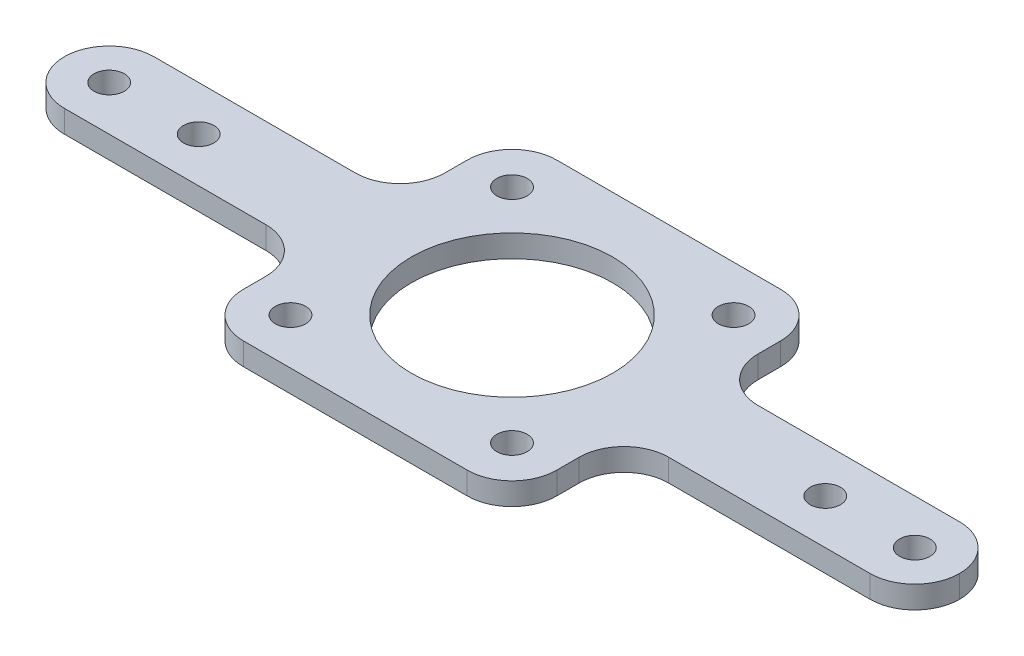
ISO-10303-21;
HEADER;
FILE_DESCRIPTION(('STEP AP214'),'2;1');
FILE_NAME('part.step','',(''),(''),'','','');
FILE_SCHEMA(('AUTOMOTIVE_DESIGN { 1 0 10303 214 1 1 1 1 }'));
ENDSEC;
DATA;
#1=APPLICATION_CONTEXT('core data for automotive mechanical design processes');
#2=APPLICATION_PROTOCOL_DEFINITION('international standard','automotive_design',2000,#1);
#3=PRODUCT_CONTEXT('',#1,'mechanical');
#4=PRODUCT('Part','Part','',(#3));
#5=PRODUCT_RELATED_PRODUCT_CATEGORY('part','',(#4));
#6=PRODUCT_DEFINITION_FORMATION('','',#4);
#7=PRODUCT_DEFINITION_CONTEXT('part definition',#1,'design');
#8=PRODUCT_DEFINITION('design','',#6,#7);
#9=PRODUCT_DEFINITION_SHAPE('','',#8);
#10=(LENGTH_UNIT() NAMED_UNIT(*) SI_UNIT(.MILLI.,.METRE.));
#11=(NAMED_UNIT(*) PLANE_ANGLE_UNIT() SI_UNIT($,.RADIAN.));
#12=(NAMED_UNIT(*) SI_UNIT($,.STERADIAN.) SOLID_ANGLE_UNIT());
#13=UNCERTAINTY_MEASURE_WITH_UNIT(LENGTH_MEASURE(1.E-05),#10,'distance_accuracy_value','');
#14=(GEOMETRIC_REPRESENTATION_CONTEXT(3) GLOBAL_UNCERTAINTY_ASSIGNED_CONTEXT((#13)) GLOBAL_UNIT_ASSIGNED_CONTEXT((#10,
#11,#12)) REPRESENTATION_CONTEXT('',''));
#15=CARTESIAN_POINT('',(0.,0.,0.));
#16=DIRECTION('',(0.,0.,1.));
#17=DIRECTION('',(1.,0.,0.));
#18=AXIS2_PLACEMENT_3D('',#15,#16,#17);
#19=CARTESIAN_POINT('',(22.225,3.175,0.));
#20=DIRECTION('',(-1.,0.,0.));
#21=DIRECTION('',(0.,0.,1.));
#22=AXIS2_PLACEMENT_3D('',#19,#20,#21);
#23=PLANE('',#22);
#24=DIRECTION('',(0.,0.,-1.));
#25=VECTOR('',#24,1.);
#26=CARTESIAN_POINT('',(22.225,3.175,0.));
#27=LINE('',#26,#25);
#28=CARTESIAN_POINT('',(22.225,3.175,15.875));
#29=VERTEX_POINT('',#28);
#30=CARTESIAN_POINT('',(22.225,3.175,12.7));
#31=VERTEX_POINT('',#30);
#32=EDGE_CURVE('E236',#29,#31,#27,.T.);
#33=ORIENTED_EDGE('',*,*,#32,.F.);
#34=DIRECTION('',(0.,-1.,0.));
#35=VECTOR('',#34,1.);
#36=CARTESIAN_POINT('',(22.225,3.175,15.875));
#37=LINE('',#36,#35);
#38=CARTESIAN_POINT('',(22.225,0.,15.875));
#39=VERTEX_POINT('',#38);
#40=EDGE_CURVE('E320',#29,#39,#37,.T.);
#41=ORIENTED_EDGE('',*,*,#40,.T.);
#42=DIRECTION('',(0.,0.,-1.));
#43=VECTOR('',#42,1.);
#44=CARTESIAN_POINT('',(22.225,0.,0.));
#45=LINE('',#44,#43);
#46=CARTESIAN_POINT('',(22.225,0.,12.7));
#47=VERTEX_POINT('',#46);
#48=EDGE_CURVE('E374',#39,#47,#45,.T.);
#49=ORIENTED_EDGE('',*,*,#48,.T.);
#50=DIRECTION('',(0.,-1.,0.));
#51=VECTOR('',#50,1.);
#52=CARTESIAN_POINT('',(22.225,3.175,12.7));
#53=LINE('',#52,#51);
#54=EDGE_CURVE('E242',#47,#31,#53,.F.);
#55=ORIENTED_EDGE('',*,*,#54,.T.);
#56=EDGE_LOOP('',(#33,#41,#49,#55));
#57=FACE_BOUND('',#56,.T.);
#58=ADVANCED_FACE('F38',(#57),#23,.F.);
#59=CARTESIAN_POINT('',(0.,3.175,6.35));
#60=DIRECTION('',(0.,0.,1.));
#61=DIRECTION('',(1.,0.,0.));
#62=AXIS2_PLACEMENT_3D('',#59,#60,#61);
#63=PLANE('',#62);
#64=DIRECTION('',(-1.,0.,0.));
#65=VECTOR('',#64,1.);
#66=CARTESIAN_POINT('',(0.,0.,6.35));
#67=LINE('',#66,#65);
#68=CARTESIAN_POINT('',(57.15,0.,6.34999999999999));
#69=VERTEX_POINT('',#68);
#70=CARTESIAN_POINT('',(28.575,0.,6.34999999999999));
#71=VERTEX_POINT('',#70);
#72=EDGE_CURVE('E222',#69,#71,#67,.T.);
#73=ORIENTED_EDGE('',*,*,#72,.F.);
#74=DIRECTION('',(0.,-1.,0.));
#75=VECTOR('',#74,1.);
#76=CARTESIAN_POINT('',(57.15,3.175,6.34999999999999));
#77=LINE('',#76,#75);
#78=CARTESIAN_POINT('',(57.15,3.175,6.34999999999999));
#79=VERTEX_POINT('',#78);
#80=EDGE_CURVE('E318',#69,#79,#77,.F.);
#81=ORIENTED_EDGE('',*,*,#80,.T.);
#82=DIRECTION('',(-1.,0.,0.));
#83=VECTOR('',#82,1.);
#84=CARTESIAN_POINT('',(0.,3.175,6.35));
#85=LINE('',#84,#83);
#86=CARTESIAN_POINT('',(28.575,3.175,6.34999999999999));
#87=VERTEX_POINT('',#86);
#88=EDGE_CURVE('E378',#79,#87,#85,.T.);
#89=ORIENTED_EDGE('',*,*,#88,.T.);
#90=DIRECTION('',(0.,-1.,0.));
#91=VECTOR('',#90,1.);
#92=CARTESIAN_POINT('',(28.575,3.175,6.34999999999999));
#93=LINE('',#92,#91);
#94=EDGE_CURVE('E239',#87,#71,#93,.T.);
#95=ORIENTED_EDGE('',*,*,#94,.T.);
#96=EDGE_LOOP('',(#73,#81,#89,#95));
#97=FACE_BOUND('',#96,.T.);
#98=ADVANCED_FACE('F409',(#97),#63,.T.);
#99=CARTESIAN_POINT('',(0.,3.175,-6.35));
#100=DIRECTION('',(0.,0.,1.));
#101=DIRECTION('',(1.,0.,0.));
#102=AXIS2_PLACEMENT_3D('',#99,#100,#101);
#103=PLANE('',#102);
#104=DIRECTION('',(-1.,0.,0.));
#105=VECTOR('',#104,1.);
#106=CARTESIAN_POINT('',(0.,3.175,-6.35));
#107=LINE('',#106,#105);
#108=CARTESIAN_POINT('',(57.15,3.175,-6.35000000000001));
#109=VERTEX_POINT('',#108);
#110=CARTESIAN_POINT('',(28.575,3.175,-6.35));
#111=VERTEX_POINT('',#110);
#112=EDGE_CURVE('E380',#109,#111,#107,.T.);
#113=ORIENTED_EDGE('',*,*,#112,.F.);
#114=DIRECTION('',(0.,-1.,0.));
#115=VECTOR('',#114,1.);
#116=CARTESIAN_POINT('',(57.15,3.175,-6.35000000000001));
#117=LINE('',#116,#115);
#118=CARTESIAN_POINT('',(57.15,0.,-6.35000000000001));
#119=VERTEX_POINT('',#118);
#120=EDGE_CURVE('E315',#109,#119,#117,.T.);
#121=ORIENTED_EDGE('',*,*,#120,.T.);
#122=DIRECTION('',(-1.,0.,0.));
#123=VECTOR('',#122,1.);
#124=CARTESIAN_POINT('',(0.,0.,-6.35));
#125=LINE('',#124,#123);
#126=CARTESIAN_POINT('',(28.575,0.,-6.35));
#127=VERTEX_POINT('',#126);
#128=EDGE_CURVE('E218',#119,#127,#125,.T.);
#129=ORIENTED_EDGE('',*,*,#128,.T.);
#130=DIRECTION('',(0.,-1.,0.));
#131=VECTOR('',#130,1.);
#132=CARTESIAN_POINT('',(28.575,3.175,-6.35));
#133=LINE('',#132,#131);
#134=EDGE_CURVE('E196',#127,#111,#133,.F.);
#135=ORIENTED_EDGE('',*,*,#134,.T.);
#136=EDGE_LOOP('',(#113,#121,#129,#135));
#137=FACE_BOUND('',#136,.T.);
#138=ADVANCED_FACE('F438',(#137),#103,.F.);
#139=CARTESIAN_POINT('',(22.225,3.175,0.));
#140=DIRECTION('',(-1.,0.,0.));
#141=DIRECTION('',(0.,0.,1.));
#142=AXIS2_PLACEMENT_3D('',#139,#140,#141);
#143=PLANE('',#142);
#144=DIRECTION('',(0.,0.,-1.));
#145=VECTOR('',#144,1.);
#146=CARTESIAN_POINT('',(22.225,0.,0.));
#147=LINE('',#146,#145);
#148=CARTESIAN_POINT('',(22.225,0.,-12.7));
#149=VERTEX_POINT('',#148);
#150=CARTESIAN_POINT('',(22.225,0.,-15.875));
#151=VERTEX_POINT('',#150);
#152=EDGE_CURVE('E207',#149,#151,#147,.T.);
#153=ORIENTED_EDGE('',*,*,#152,.T.);
#154=DIRECTION('',(0.,-1.,0.));
#155=VECTOR('',#154,1.);
#156=CARTESIAN_POINT('',(22.225,3.175,-15.875));
#157=LINE('',#156,#155);
#158=CARTESIAN_POINT('',(22.225,3.175,-15.875));
#159=VERTEX_POINT('',#158);
#160=EDGE_CURVE('E313',#151,#159,#157,.F.);
#161=ORIENTED_EDGE('',*,*,#160,.T.);
#162=DIRECTION('',(0.,0.,-1.));
#163=VECTOR('',#162,1.);
#164=CARTESIAN_POINT('',(22.225,3.175,0.));
#165=LINE('',#164,#163);
#166=CARTESIAN_POINT('',(22.225,3.175,-12.7));
#167=VERTEX_POINT('',#166);
#168=EDGE_CURVE('E210',#167,#159,#165,.T.);
#169=ORIENTED_EDGE('',*,*,#168,.F.);
#170=DIRECTION('',(0.,-1.,0.));
#171=VECTOR('',#170,1.);
#172=CARTESIAN_POINT('',(22.225,0.,-12.7));
#173=LINE('',#172,#171);
#174=EDGE_CURVE('E194',#167,#149,#173,.T.);
#175=ORIENTED_EDGE('',*,*,#174,.T.);
#176=EDGE_LOOP('',(#153,#161,#169,#175));
#177=FACE_BOUND('',#176,.T.);
#178=ADVANCED_FACE('F206',(#177),#143,.F.);
#179=CARTESIAN_POINT('',(0.,3.175,-22.225));
#180=DIRECTION('',(0.,0.,-1.));
#181=DIRECTION('',(-1.,0.,0.));
#182=AXIS2_PLACEMENT_3D('',#179,#180,#181);
#183=PLANE('',#182);
#184=DIRECTION('',(1.,0.,0.));
#185=VECTOR('',#184,1.);
#186=CARTESIAN_POINT('',(0.,0.,-22.225));
#187=LINE('',#186,#185);
#188=CARTESIAN_POINT('',(-15.875,0.,-22.225));
#189=VERTEX_POINT('',#188);
#190=CARTESIAN_POINT('',(15.875,0.,-22.225));
#191=VERTEX_POINT('',#190);
#192=EDGE_CURVE('E217',#189,#191,#187,.T.);
#193=ORIENTED_EDGE('',*,*,#192,.F.);
#194=DIRECTION('',(0.,-1.,0.));
#195=VECTOR('',#194,1.);
#196=CARTESIAN_POINT('',(-15.875,3.175,-22.225));
#197=LINE('',#196,#195);
#198=CARTESIAN_POINT('',(-15.875,3.175,-22.225));
#199=VERTEX_POINT('',#198);
#200=EDGE_CURVE('E311',#189,#199,#197,.F.);
#201=ORIENTED_EDGE('',*,*,#200,.T.);
#202=DIRECTION('',(1.,0.,0.));
#203=VECTOR('',#202,1.);
#204=CARTESIAN_POINT('',(0.,3.175,-22.225));
#205=LINE('',#204,#203);
#206=CARTESIAN_POINT('',(15.875,3.175,-22.225));
#207=VERTEX_POINT('',#206);
#208=EDGE_CURVE('E383',#199,#207,#205,.T.);
#209=ORIENTED_EDGE('',*,*,#208,.T.);
#210=DIRECTION('',(0.,-1.,0.));
#211=VECTOR('',#210,1.);
#212=CARTESIAN_POINT('',(15.875,0.,-22.225));
#213=LINE('',#212,#211);
#214=EDGE_CURVE('E308',#207,#191,#213,.T.);
#215=ORIENTED_EDGE('',*,*,#214,.T.);
#216=EDGE_LOOP('',(#193,#201,#209,#215));
#217=FACE_BOUND('',#216,.T.);
#218=ADVANCED_FACE('F481',(#217),#183,.T.);
#219=CARTESIAN_POINT('',(-22.225,3.175,0.));
#220=DIRECTION('',(-1.,0.,0.));
#221=DIRECTION('',(0.,0.,1.));
#222=AXIS2_PLACEMENT_3D('',#219,#220,#221);
#223=PLANE('',#222);
#224=DIRECTION('',(0.,0.,-1.));
#225=VECTOR('',#224,1.);
#226=CARTESIAN_POINT('',(-22.225,3.175,0.));
#227=LINE('',#226,#225);
#228=CARTESIAN_POINT('',(-22.225,3.175,-12.7));
#229=VERTEX_POINT('',#228);
#230=CARTESIAN_POINT('',(-22.225,3.175,-15.875));
#231=VERTEX_POINT('',#230);
#232=EDGE_CURVE('E386',#229,#231,#227,.T.);
#233=ORIENTED_EDGE('',*,*,#232,.T.);
#234=DIRECTION('',(0.,-1.,0.));
#235=VECTOR('',#234,1.);
#236=CARTESIAN_POINT('',(-22.225,3.175,-15.875));
#237=LINE('',#236,#235);
#238=CARTESIAN_POINT('',(-22.225,0.,-15.875));
#239=VERTEX_POINT('',#238);
#240=EDGE_CURVE('E305',#231,#239,#237,.T.);
#241=ORIENTED_EDGE('',*,*,#240,.T.);
#242=DIRECTION('',(0.,0.,-1.));
#243=VECTOR('',#242,1.);
#244=CARTESIAN_POINT('',(-22.225,0.,0.));
#245=LINE('',#244,#243);
#246=CARTESIAN_POINT('',(-22.225,0.,-12.7));
#247=VERTEX_POINT('',#246);
#248=EDGE_CURVE('E220',#247,#239,#245,.T.);
#249=ORIENTED_EDGE('',*,*,#248,.F.);
#250=DIRECTION('',(0.,-1.,0.));
#251=VECTOR('',#250,1.);
#252=CARTESIAN_POINT('',(-22.225,3.175,-12.7));
#253=LINE('',#252,#251);
#254=EDGE_CURVE('E201',#247,#229,#253,.F.);
#255=ORIENTED_EDGE('',*,*,#254,.T.);
#256=EDGE_LOOP('',(#233,#241,#249,#255));
#257=FACE_BOUND('',#256,.T.);
#258=ADVANCED_FACE('F487',(#257),#223,.T.);
#259=CARTESIAN_POINT('',(0.,3.175,-6.35));
#260=DIRECTION('',(0.,0.,1.));
#261=DIRECTION('',(1.,0.,0.));
#262=AXIS2_PLACEMENT_3D('',#259,#260,#261);
#263=PLANE('',#262);
#264=DIRECTION('',(-1.,0.,0.));
#265=VECTOR('',#264,1.);
#266=CARTESIAN_POINT('',(0.,0.,-6.35));
#267=LINE('',#266,#265);
#268=CARTESIAN_POINT('',(-28.575,0.,-6.35));
#269=VERTEX_POINT('',#268);
#270=CARTESIAN_POINT('',(-57.15,0.,-6.34999999999999));
#271=VERTEX_POINT('',#270);
#272=EDGE_CURVE('E228',#269,#271,#267,.T.);
#273=ORIENTED_EDGE('',*,*,#272,.T.);
#274=DIRECTION('',(0.,-1.,0.));
#275=VECTOR('',#274,1.);
#276=CARTESIAN_POINT('',(-57.15,3.175,-6.34999999999999));
#277=LINE('',#276,#275);
#278=CARTESIAN_POINT('',(-57.15,3.175,-6.34999999999999));
#279=VERTEX_POINT('',#278);
#280=EDGE_CURVE('E303',#271,#279,#277,.F.);
#281=ORIENTED_EDGE('',*,*,#280,.T.);
#282=DIRECTION('',(-1.,0.,0.));
#283=VECTOR('',#282,1.);
#284=CARTESIAN_POINT('',(0.,3.175,-6.35));
#285=LINE('',#284,#283);
#286=CARTESIAN_POINT('',(-28.575,3.175,-6.35));
#287=VERTEX_POINT('',#286);
#288=EDGE_CURVE('E389',#287,#279,#285,.T.);
#289=ORIENTED_EDGE('',*,*,#288,.F.);
#290=DIRECTION('',(0.,-1.,0.));
#291=VECTOR('',#290,1.);
#292=CARTESIAN_POINT('',(-28.575,3.175,-6.35));
#293=LINE('',#292,#291);
#294=EDGE_CURVE('E250',#287,#269,#293,.T.);
#295=ORIENTED_EDGE('',*,*,#294,.T.);
#296=EDGE_LOOP('',(#273,#281,#289,#295));
#297=FACE_BOUND('',#296,.T.);
#298=ADVANCED_FACE('F495',(#297),#263,.F.);
#299=CARTESIAN_POINT('',(0.,3.175,6.35));
#300=DIRECTION('',(0.,0.,1.));
#301=DIRECTION('',(1.,0.,0.));
#302=AXIS2_PLACEMENT_3D('',#299,#300,#301);
#303=PLANE('',#302);
#304=DIRECTION('',(-1.,0.,0.));
#305=VECTOR('',#304,1.);
#306=CARTESIAN_POINT('',(0.,3.175,6.35));
#307=LINE('',#306,#305);
#308=CARTESIAN_POINT('',(-28.575,3.175,6.35));
#309=VERTEX_POINT('',#308);
#310=CARTESIAN_POINT('',(-57.15,3.175,6.35));
#311=VERTEX_POINT('',#310);
#312=EDGE_CURVE('E392',#309,#311,#307,.T.);
#313=ORIENTED_EDGE('',*,*,#312,.T.);
#314=DIRECTION('',(0.,-1.,0.));
#315=VECTOR('',#314,1.);
#316=CARTESIAN_POINT('',(-57.15,3.175,6.35));
#317=LINE('',#316,#315);
#318=CARTESIAN_POINT('',(-57.15,0.,6.35));
#319=VERTEX_POINT('',#318);
#320=EDGE_CURVE('E270',#311,#319,#317,.T.);
#321=ORIENTED_EDGE('',*,*,#320,.T.);
#322=DIRECTION('',(-1.,0.,0.));
#323=VECTOR('',#322,1.);
#324=CARTESIAN_POINT('',(0.,0.,6.35));
#325=LINE('',#324,#323);
#326=CARTESIAN_POINT('',(-28.575,0.,6.35));
#327=VERTEX_POINT('',#326);
#328=EDGE_CURVE('E231',#327,#319,#325,.T.);
#329=ORIENTED_EDGE('',*,*,#328,.F.);
#330=DIRECTION('',(0.,-1.,0.));
#331=VECTOR('',#330,1.);
#332=CARTESIAN_POINT('',(-28.575,3.175,6.35));
#333=LINE('',#332,#331);
#334=EDGE_CURVE('E248',#327,#309,#333,.F.);
#335=ORIENTED_EDGE('',*,*,#334,.T.);
#336=EDGE_LOOP('',(#313,#321,#329,#335));
#337=FACE_BOUND('',#336,.T.);
#338=ADVANCED_FACE('F503',(#337),#303,.T.);
#339=CARTESIAN_POINT('',(-22.225,3.175,0.));
#340=DIRECTION('',(-1.,0.,0.));
#341=DIRECTION('',(0.,0.,1.));
#342=AXIS2_PLACEMENT_3D('',#339,#340,#341);
#343=PLANE('',#342);
#344=DIRECTION('',(0.,0.,-1.));
#345=VECTOR('',#344,1.);
#346=CARTESIAN_POINT('',(-22.225,0.,0.));
#347=LINE('',#346,#345);
#348=CARTESIAN_POINT('',(-22.225,0.,15.875));
#349=VERTEX_POINT('',#348);
#350=CARTESIAN_POINT('',(-22.225,0.,12.7));
#351=VERTEX_POINT('',#350);
#352=EDGE_CURVE('E233',#349,#351,#347,.T.);
#353=ORIENTED_EDGE('',*,*,#352,.F.);
#354=DIRECTION('',(0.,-1.,0.));
#355=VECTOR('',#354,1.);
#356=CARTESIAN_POINT('',(-22.225,3.175,15.875));
#357=LINE('',#356,#355);
#358=CARTESIAN_POINT('',(-22.225,3.175,15.875));
#359=VERTEX_POINT('',#358);
#360=EDGE_CURVE('E11',#349,#359,#357,.F.);
#361=ORIENTED_EDGE('',*,*,#360,.T.);
#362=DIRECTION('',(0.,0.,-1.));
#363=VECTOR('',#362,1.);
#364=CARTESIAN_POINT('',(-22.225,3.175,0.));
#365=LINE('',#364,#363);
#366=CARTESIAN_POINT('',(-22.225,3.175,12.7));
#367=VERTEX_POINT('',#366);
#368=EDGE_CURVE('E395',#359,#367,#365,.T.);
#369=ORIENTED_EDGE('',*,*,#368,.T.);
#370=DIRECTION('',(0.,-1.,0.));
#371=VECTOR('',#370,1.);
#372=CARTESIAN_POINT('',(-22.225,0.,12.7));
#373=LINE('',#372,#371);
#374=EDGE_CURVE('E245',#367,#351,#373,.T.);
#375=ORIENTED_EDGE('',*,*,#374,.T.);
#376=EDGE_LOOP('',(#353,#361,#369,#375));
#377=FACE_BOUND('',#376,.T.);
#378=ADVANCED_FACE('F511',(#377),#343,.T.);
#379=CARTESIAN_POINT('',(0.,3.175,22.225));
#380=DIRECTION('',(0.,0.,-1.));
#381=DIRECTION('',(-1.,0.,0.));
#382=AXIS2_PLACEMENT_3D('',#379,#380,#381);
#383=PLANE('',#382);
#384=DIRECTION('',(1.,0.,0.));
#385=VECTOR('',#384,1.);
#386=CARTESIAN_POINT('',(0.,0.,22.225));
#387=LINE('',#386,#385);
#388=CARTESIAN_POINT('',(-15.875,0.,22.225));
#389=VERTEX_POINT('',#388);
#390=CARTESIAN_POINT('',(15.875,0.,22.225));
#391=VERTEX_POINT('',#390);
#392=EDGE_CURVE('E235',#389,#391,#387,.T.);
#393=ORIENTED_EDGE('',*,*,#392,.T.);
#394=DIRECTION('',(0.,-1.,0.));
#395=VECTOR('',#394,1.);
#396=CARTESIAN_POINT('',(15.875,3.175,22.225));
#397=LINE('',#396,#395);
#398=CARTESIAN_POINT('',(15.875,3.175,22.225));
#399=VERTEX_POINT('',#398);
#400=EDGE_CURVE('E47',#391,#399,#397,.F.);
#401=ORIENTED_EDGE('',*,*,#400,.T.);
#402=DIRECTION('',(1.,0.,0.));
#403=VECTOR('',#402,1.);
#404=CARTESIAN_POINT('',(0.,3.175,22.225));
#405=LINE('',#404,#403);
#406=CARTESIAN_POINT('',(-15.875,3.175,22.225));
#407=VERTEX_POINT('',#406);
#408=EDGE_CURVE('E211',#407,#399,#405,.T.);
#409=ORIENTED_EDGE('',*,*,#408,.F.);
#410=DIRECTION('',(0.,-1.,0.));
#411=VECTOR('',#410,1.);
#412=CARTESIAN_POINT('',(-15.875,0.,22.225));
#413=LINE('',#412,#411);
#414=EDGE_CURVE('E323',#407,#389,#413,.T.);
#415=ORIENTED_EDGE('',*,*,#414,.T.);
#416=EDGE_LOOP('',(#393,#401,#409,#415));
#417=FACE_BOUND('',#416,.T.);
#418=ADVANCED_FACE('F419',(#417),#383,.F.);
#419=CARTESIAN_POINT('',(0.,3.175,0.));
#420=DIRECTION('',(0.,1.,0.));
#421=DIRECTION('',(0.,0.,1.));
#422=AXIS2_PLACEMENT_3D('',#419,#420,#421);
#423=PLANE('',#422);
#424=CARTESIAN_POINT('',(-44.45,3.175,0.));
#425=DIRECTION('',(0.,1.,0.));
#426=DIRECTION('',(0.,0.,1.));
#427=AXIS2_PLACEMENT_3D('',#424,#425,#426);
#428=CIRCLE('',#427,2.15264999999999);
#429=CARTESIAN_POINT('',(-44.45,3.175,2.15264999999999));
#430=VERTEX_POINT('',#429);
#431=EDGE_CURVE('E794',#430,#430,#428,.T.);
#432=ORIENTED_EDGE('',*,*,#431,.F.);
#433=EDGE_LOOP('',(#432));
#434=FACE_BOUND('',#433,.T.);
#435=CARTESIAN_POINT('',(-57.15,3.175,0.));
#436=DIRECTION('',(0.,1.,0.));
#437=DIRECTION('',(0.,0.,1.));
#438=AXIS2_PLACEMENT_3D('',#435,#436,#437);
#439=CIRCLE('',#438,2.15264999999999);
#440=CARTESIAN_POINT('',(-57.15,3.175,2.15264999999999));
#441=VERTEX_POINT('',#440);
#442=EDGE_CURVE('E796',#441,#441,#439,.T.);
#443=ORIENTED_EDGE('',*,*,#442,.F.);
#444=EDGE_LOOP('',(#443));
#445=FACE_BOUND('',#444,.T.);
#446=CARTESIAN_POINT('',(44.45,3.175,0.));
#447=DIRECTION('',(0.,1.,0.));
#448=DIRECTION('',(0.,0.,1.));
#449=AXIS2_PLACEMENT_3D('',#446,#447,#448);
#450=CIRCLE('',#449,2.15264999999999);
#451=CARTESIAN_POINT('',(44.45,3.175,2.15264999999999));
#452=VERTEX_POINT('',#451);
#453=EDGE_CURVE('E804',#452,#452,#450,.T.);
#454=ORIENTED_EDGE('',*,*,#453,.F.);
#455=EDGE_LOOP('',(#454));
#456=FACE_BOUND('',#455,.T.);
#457=CARTESIAN_POINT('',(57.15,3.175,0.));
#458=DIRECTION('',(0.,1.,0.));
#459=DIRECTION('',(0.,0.,1.));
#460=AXIS2_PLACEMENT_3D('',#457,#458,#459);
#461=CIRCLE('',#460,2.15264999999999);
#462=CARTESIAN_POINT('',(57.15,3.175,2.15264999999999));
#463=VERTEX_POINT('',#462);
#464=EDGE_CURVE('E341',#463,#463,#461,.T.);
#465=ORIENTED_EDGE('',*,*,#464,.F.);
#466=EDGE_LOOP('',(#465));
#467=FACE_BOUND('',#466,.T.);
#468=CARTESIAN_POINT('',(-15.7154482118712,3.175,-15.7154482118709));
#469=DIRECTION('',(0.,1.,0.));
#470=DIRECTION('',(0.,0.,1.));
#471=AXIS2_PLACEMENT_3D('',#468,#469,#470);
#472=CIRCLE('',#471,2.15264999999999);
#473=CARTESIAN_POINT('',(-15.7154482118712,3.175,-13.5627982118709));
#474=VERTEX_POINT('',#473);
#475=EDGE_CURVE('E328',#474,#474,#472,.T.);
#476=ORIENTED_EDGE('',*,*,#475,.F.);
#477=EDGE_LOOP('',(#476));
#478=FACE_BOUND('',#477,.T.);
#479=CARTESIAN_POINT('',(15.715448211871,3.175,-15.715448211871));
#480=DIRECTION('',(0.,1.,0.));
#481=DIRECTION('',(0.,0.,1.));
#482=AXIS2_PLACEMENT_3D('',#479,#480,#481);
#483=CIRCLE('',#482,2.15264999999999);
#484=CARTESIAN_POINT('',(15.715448211871,3.175,-13.562798211871));
#485=VERTEX_POINT('',#484);
#486=EDGE_CURVE('E352',#485,#485,#483,.T.);
#487=ORIENTED_EDGE('',*,*,#486,.F.);
#488=EDGE_LOOP('',(#487));
#489=FACE_BOUND('',#488,.T.);
#490=CARTESIAN_POINT('',(15.715448211871,3.175,15.715448211871));
#491=DIRECTION('',(0.,1.,0.));
#492=DIRECTION('',(0.,0.,1.));
#493=AXIS2_PLACEMENT_3D('',#490,#491,#492);
#494=CIRCLE('',#493,2.15264999999999);
#495=CARTESIAN_POINT('',(15.715448211871,3.175,17.868098211871));
#496=VERTEX_POINT('',#495);
#497=EDGE_CURVE('E358',#496,#496,#494,.T.);
#498=ORIENTED_EDGE('',*,*,#497,.F.);
#499=EDGE_LOOP('',(#498));
#500=FACE_BOUND('',#499,.T.);
#501=CARTESIAN_POINT('',(-15.715448211871,3.175,15.715448211871));
#502=DIRECTION('',(0.,1.,0.));
#503=DIRECTION('',(0.,0.,1.));
#504=AXIS2_PLACEMENT_3D('',#501,#502,#503);
#505=CIRCLE('',#504,2.15264999999999);
#506=CARTESIAN_POINT('',(-15.715448211871,3.175,17.868098211871));
#507=VERTEX_POINT('',#506);
#508=EDGE_CURVE('E364',#507,#507,#505,.T.);
#509=ORIENTED_EDGE('',*,*,#508,.F.);
#510=EDGE_LOOP('',(#509));
#511=FACE_BOUND('',#510,.T.);
#512=CARTESIAN_POINT('',(0.,3.175,0.));
#513=DIRECTION('',(0.,1.,0.));
#514=DIRECTION('',(0.,0.,1.));
#515=AXIS2_PLACEMENT_3D('',#512,#513,#514);
#516=CIRCLE('',#515,14.2875);
#517=CARTESIAN_POINT('',(0.,3.175,14.2875));
#518=VERTEX_POINT('',#517);
#519=EDGE_CURVE('E370',#518,#518,#516,.T.);
#520=ORIENTED_EDGE('',*,*,#519,.F.);
#521=EDGE_LOOP('',(#520));
#522=FACE_BOUND('',#521,.T.);
#523=CARTESIAN_POINT('',(-57.15,3.175,0.));
#524=DIRECTION('',(0.,1.,0.));
#525=DIRECTION('',(0.,0.,1.));
#526=AXIS2_PLACEMENT_3D('',#523,#524,#525);
#527=CIRCLE('',#526,6.35);
#528=CARTESIAN_POINT('',(-63.5,3.175,0.));
#529=VERTEX_POINT('',#528);
#530=EDGE_CURVE('E299',#279,#529,#527,.T.);
#531=ORIENTED_EDGE('',*,*,#530,.T.);
#532=CARTESIAN_POINT('',(-57.15,3.175,0.));
#533=DIRECTION('',(0.,1.,0.));
#534=DIRECTION('',(0.,0.,1.));
#535=AXIS2_PLACEMENT_3D('',#532,#533,#534);
#536=CIRCLE('',#535,6.35);
#537=EDGE_CURVE('E301',#529,#311,#536,.T.);
#538=ORIENTED_EDGE('',*,*,#537,.T.);
#539=ORIENTED_EDGE('',*,*,#312,.F.);
#540=CARTESIAN_POINT('',(-28.575,3.175,12.7));
#541=DIRECTION('',(0.,1.,0.));
#542=DIRECTION('',(0.,0.,1.));
#543=AXIS2_PLACEMENT_3D('',#540,#541,#542);
#544=CIRCLE('',#543,6.35);
#545=EDGE_CURVE('E263',#309,#367,#544,.F.);
#546=ORIENTED_EDGE('',*,*,#545,.T.);
#547=ORIENTED_EDGE('',*,*,#368,.F.);
#548=CARTESIAN_POINT('',(-15.875,3.175,15.875));
#549=DIRECTION('',(0.,1.,0.));
#550=DIRECTION('',(0.,0.,1.));
#551=AXIS2_PLACEMENT_3D('',#548,#549,#550);
#552=CIRCLE('',#551,6.35);
#553=EDGE_CURVE('E61',#359,#407,#552,.T.);
#554=ORIENTED_EDGE('',*,*,#553,.T.);
#555=ORIENTED_EDGE('',*,*,#408,.T.);
#556=CARTESIAN_POINT('',(15.875,3.175,15.875));
#557=DIRECTION('',(0.,1.,0.));
#558=DIRECTION('',(0.,0.,1.));
#559=AXIS2_PLACEMENT_3D('',#556,#557,#558);
#560=CIRCLE('',#559,6.35);
#561=EDGE_CURVE('E289',#399,#29,#560,.T.);
#562=ORIENTED_EDGE('',*,*,#561,.T.);
#563=ORIENTED_EDGE('',*,*,#32,.T.);
#564=CARTESIAN_POINT('',(28.575,3.175,12.7));
#565=DIRECTION('',(0.,1.,0.));
#566=DIRECTION('',(0.,0.,1.));
#567=AXIS2_PLACEMENT_3D('',#564,#565,#566);
#568=CIRCLE('',#567,6.35);
#569=EDGE_CURVE('E258',#31,#87,#568,.F.);
#570=ORIENTED_EDGE('',*,*,#569,.T.);
#571=ORIENTED_EDGE('',*,*,#88,.F.);
#572=CARTESIAN_POINT('',(57.15,3.175,0.));
#573=DIRECTION('',(0.,1.,0.));
#574=DIRECTION('',(0.,0.,1.));
#575=AXIS2_PLACEMENT_3D('',#572,#573,#574);
#576=CIRCLE('',#575,6.35);
#577=CARTESIAN_POINT('',(63.5,3.175,0.));
#578=VERTEX_POINT('',#577);
#579=EDGE_CURVE('E291',#79,#578,#576,.T.);
#580=ORIENTED_EDGE('',*,*,#579,.T.);
#581=CARTESIAN_POINT('',(57.15,3.175,0.));
#582=DIRECTION('',(0.,1.,0.));
#583=DIRECTION('',(0.,0.,1.));
#584=AXIS2_PLACEMENT_3D('',#581,#582,#583);
#585=CIRCLE('',#584,6.35);
#586=EDGE_CURVE('E293',#578,#109,#585,.T.);
#587=ORIENTED_EDGE('',*,*,#586,.T.);
#588=ORIENTED_EDGE('',*,*,#112,.T.);
#589=CARTESIAN_POINT('',(28.575,3.175,-12.7));
#590=DIRECTION('',(0.,1.,0.));
#591=DIRECTION('',(0.,0.,1.));
#592=AXIS2_PLACEMENT_3D('',#589,#590,#591);
#593=CIRCLE('',#592,6.35);
#594=EDGE_CURVE('E200',#111,#167,#593,.F.);
#595=ORIENTED_EDGE('',*,*,#594,.T.);
#596=ORIENTED_EDGE('',*,*,#168,.T.);
#597=CARTESIAN_POINT('',(15.875,3.175,-15.875));
#598=DIRECTION('',(0.,1.,0.));
#599=DIRECTION('',(0.,0.,1.));
#600=AXIS2_PLACEMENT_3D('',#597,#598,#599);
#601=CIRCLE('',#600,6.35);
#602=EDGE_CURVE('E295',#159,#207,#601,.T.);
#603=ORIENTED_EDGE('',*,*,#602,.T.);
#604=ORIENTED_EDGE('',*,*,#208,.F.);
#605=CARTESIAN_POINT('',(-15.875,3.175,-15.875));
#606=DIRECTION('',(0.,1.,0.));
#607=DIRECTION('',(0.,0.,1.));
#608=AXIS2_PLACEMENT_3D('',#605,#606,#607);
#609=CIRCLE('',#608,6.35);
#610=EDGE_CURVE('E297',#199,#231,#609,.T.);
#611=ORIENTED_EDGE('',*,*,#610,.T.);
#612=ORIENTED_EDGE('',*,*,#232,.F.);
#613=CARTESIAN_POINT('',(-28.575,3.175,-12.7));
#614=DIRECTION('',(0.,1.,0.));
#615=DIRECTION('',(0.,0.,1.));
#616=AXIS2_PLACEMENT_3D('',#613,#614,#615);
#617=CIRCLE('',#616,6.35);
#618=EDGE_CURVE('E268',#229,#287,#617,.F.);
#619=ORIENTED_EDGE('',*,*,#618,.T.);
#620=ORIENTED_EDGE('',*,*,#288,.T.);
#621=EDGE_LOOP('',(#531,#538,#539,#546,#547,#554,#555,#562,#563,#570,#571,#580,#587,#588,#595,
#596,#603,#604,#611,#612,#619,#620));
#622=FACE_BOUND('',#621,.T.);
#623=ADVANCED_FACE('F412',(#434,#445,#456,#467,#478,#489,#500,#511,#522,#622),#423,.T.);
#624=CARTESIAN_POINT('',(0.,0.,0.));
#625=DIRECTION('',(0.,1.,0.));
#626=DIRECTION('',(0.,0.,1.));
#627=AXIS2_PLACEMENT_3D('',#624,#625,#626);
#628=PLANE('',#627);
#629=CARTESIAN_POINT('',(-44.45,0.,0.));
#630=DIRECTION('',(0.,1.,0.));
#631=DIRECTION('',(0.,0.,1.));
#632=AXIS2_PLACEMENT_3D('',#629,#630,#631);
#633=CIRCLE('',#632,2.15265);
#634=CARTESIAN_POINT('',(-44.45,0.,2.15265));
#635=VERTEX_POINT('',#634);
#636=EDGE_CURVE('E791',#635,#635,#633,.T.);
#637=ORIENTED_EDGE('',*,*,#636,.T.);
#638=EDGE_LOOP('',(#637));
#639=FACE_BOUND('',#638,.T.);
#640=CARTESIAN_POINT('',(-57.15,0.,0.));
#641=DIRECTION('',(0.,1.,0.));
#642=DIRECTION('',(0.,0.,1.));
#643=AXIS2_PLACEMENT_3D('',#640,#641,#642);
#644=CIRCLE('',#643,2.15265);
#645=CARTESIAN_POINT('',(-57.15,0.,2.15265));
#646=VERTEX_POINT('',#645);
#647=EDGE_CURVE('E801',#646,#646,#644,.T.);
#648=ORIENTED_EDGE('',*,*,#647,.T.);
#649=EDGE_LOOP('',(#648));
#650=FACE_BOUND('',#649,.T.);
#651=CARTESIAN_POINT('',(44.45,0.,0.));
#652=DIRECTION('',(0.,1.,0.));
#653=DIRECTION('',(0.,0.,1.));
#654=AXIS2_PLACEMENT_3D('',#651,#652,#653);
#655=CIRCLE('',#654,2.15265);
#656=CARTESIAN_POINT('',(44.45,0.,2.15265));
#657=VERTEX_POINT('',#656);
#658=EDGE_CURVE('E346',#657,#657,#655,.T.);
#659=ORIENTED_EDGE('',*,*,#658,.T.);
#660=EDGE_LOOP('',(#659));
#661=FACE_BOUND('',#660,.T.);
#662=CARTESIAN_POINT('',(57.15,0.,0.));
#663=DIRECTION('',(0.,1.,0.));
#664=DIRECTION('',(0.,0.,1.));
#665=AXIS2_PLACEMENT_3D('',#662,#663,#664);
#666=CIRCLE('',#665,2.15265);
#667=CARTESIAN_POINT('',(57.15,0.,2.15265));
#668=VERTEX_POINT('',#667);
#669=EDGE_CURVE('E336',#668,#668,#666,.T.);
#670=ORIENTED_EDGE('',*,*,#669,.T.);
#671=EDGE_LOOP('',(#670));
#672=FACE_BOUND('',#671,.T.);
#673=CARTESIAN_POINT('',(-15.7154482118712,0.,-15.7154482118709));
#674=DIRECTION('',(0.,1.,0.));
#675=DIRECTION('',(0.,0.,1.));
#676=AXIS2_PLACEMENT_3D('',#673,#674,#675);
#677=CIRCLE('',#676,2.15265);
#678=CARTESIAN_POINT('',(-15.7154482118712,0.,-13.5627982118709));
#679=VERTEX_POINT('',#678);
#680=EDGE_CURVE('E333',#679,#679,#677,.T.);
#681=ORIENTED_EDGE('',*,*,#680,.T.);
#682=EDGE_LOOP('',(#681));
#683=FACE_BOUND('',#682,.T.);
#684=CARTESIAN_POINT('',(15.715448211871,0.,-15.715448211871));
#685=DIRECTION('',(0.,1.,0.));
#686=DIRECTION('',(0.,0.,1.));
#687=AXIS2_PLACEMENT_3D('',#684,#685,#686);
#688=CIRCLE('',#687,2.15265);
#689=CARTESIAN_POINT('',(15.715448211871,0.,-13.562798211871));
#690=VERTEX_POINT('',#689);
#691=EDGE_CURVE('E355',#690,#690,#688,.T.);
#692=ORIENTED_EDGE('',*,*,#691,.T.);
#693=EDGE_LOOP('',(#692));
#694=FACE_BOUND('',#693,.T.);
#695=CARTESIAN_POINT('',(15.715448211871,0.,15.715448211871));
#696=DIRECTION('',(0.,1.,0.));
#697=DIRECTION('',(0.,0.,1.));
#698=AXIS2_PLACEMENT_3D('',#695,#696,#697);
#699=CIRCLE('',#698,2.15265);
#700=CARTESIAN_POINT('',(15.715448211871,0.,17.868098211871));
#701=VERTEX_POINT('',#700);
#702=EDGE_CURVE('E361',#701,#701,#699,.T.);
#703=ORIENTED_EDGE('',*,*,#702,.T.);
#704=EDGE_LOOP('',(#703));
#705=FACE_BOUND('',#704,.T.);
#706=CARTESIAN_POINT('',(-15.715448211871,0.,15.715448211871));
#707=DIRECTION('',(0.,1.,0.));
#708=DIRECTION('',(0.,0.,1.));
#709=AXIS2_PLACEMENT_3D('',#706,#707,#708);
#710=CIRCLE('',#709,2.15265);
#711=CARTESIAN_POINT('',(-15.715448211871,0.,17.868098211871));
#712=VERTEX_POINT('',#711);
#713=EDGE_CURVE('E367',#712,#712,#710,.T.);
#714=ORIENTED_EDGE('',*,*,#713,.T.);
#715=EDGE_LOOP('',(#714));
#716=FACE_BOUND('',#715,.T.);
#717=CARTESIAN_POINT('',(0.,0.,0.));
#718=DIRECTION('',(0.,1.,0.));
#719=DIRECTION('',(0.,0.,1.));
#720=AXIS2_PLACEMENT_3D('',#717,#718,#719);
#721=CIRCLE('',#720,14.2875);
#722=CARTESIAN_POINT('',(0.,0.,14.2875));
#723=VERTEX_POINT('',#722);
#724=EDGE_CURVE('E371',#723,#723,#721,.T.);
#725=ORIENTED_EDGE('',*,*,#724,.T.);
#726=EDGE_LOOP('',(#725));
#727=FACE_BOUND('',#726,.T.);
#728=ORIENTED_EDGE('',*,*,#328,.T.);
#729=CARTESIAN_POINT('',(-57.15,0.,0.));
#730=DIRECTION('',(0.,1.,0.));
#731=DIRECTION('',(0.,0.,1.));
#732=AXIS2_PLACEMENT_3D('',#729,#730,#731);
#733=CIRCLE('',#732,6.35);
#734=CARTESIAN_POINT('',(-63.5,0.,0.));
#735=VERTEX_POINT('',#734);
#736=EDGE_CURVE('E286',#319,#735,#733,.F.);
#737=ORIENTED_EDGE('',*,*,#736,.T.);
#738=CARTESIAN_POINT('',(-57.15,0.,0.));
#739=DIRECTION('',(0.,1.,0.));
#740=DIRECTION('',(0.,0.,1.));
#741=AXIS2_PLACEMENT_3D('',#738,#739,#740);
#742=CIRCLE('',#741,6.35);
#743=EDGE_CURVE('E284',#735,#271,#742,.F.);
#744=ORIENTED_EDGE('',*,*,#743,.T.);
#745=ORIENTED_EDGE('',*,*,#272,.F.);
#746=CARTESIAN_POINT('',(-28.575,0.,-12.7));
#747=DIRECTION('',(0.,1.,0.));
#748=DIRECTION('',(0.,0.,1.));
#749=AXIS2_PLACEMENT_3D('',#746,#747,#748);
#750=CIRCLE('',#749,6.35);
#751=EDGE_CURVE('E266',#269,#247,#750,.T.);
#752=ORIENTED_EDGE('',*,*,#751,.T.);
#753=ORIENTED_EDGE('',*,*,#248,.T.);
#754=CARTESIAN_POINT('',(-15.875,0.,-15.875));
#755=DIRECTION('',(0.,1.,0.));
#756=DIRECTION('',(0.,0.,1.));
#757=AXIS2_PLACEMENT_3D('',#754,#755,#756);
#758=CIRCLE('',#757,6.35);
#759=EDGE_CURVE('E282',#239,#189,#758,.F.);
#760=ORIENTED_EDGE('',*,*,#759,.T.);
#761=ORIENTED_EDGE('',*,*,#192,.T.);
#762=CARTESIAN_POINT('',(15.875,0.,-15.875));
#763=DIRECTION('',(0.,1.,0.));
#764=DIRECTION('',(0.,0.,1.));
#765=AXIS2_PLACEMENT_3D('',#762,#763,#764);
#766=CIRCLE('',#765,6.35);
#767=EDGE_CURVE('E216',#191,#151,#766,.F.);
#768=ORIENTED_EDGE('',*,*,#767,.T.);
#769=ORIENTED_EDGE('',*,*,#152,.F.);
#770=CARTESIAN_POINT('',(28.575,0.,-12.7));
#771=DIRECTION('',(0.,1.,0.));
#772=DIRECTION('',(0.,0.,1.));
#773=AXIS2_PLACEMENT_3D('',#770,#771,#772);
#774=CIRCLE('',#773,6.35);
#775=EDGE_CURVE('E190',#149,#127,#774,.T.);
#776=ORIENTED_EDGE('',*,*,#775,.T.);
#777=ORIENTED_EDGE('',*,*,#128,.F.);
#778=CARTESIAN_POINT('',(57.15,0.,0.));
#779=DIRECTION('',(0.,1.,0.));
#780=DIRECTION('',(0.,0.,1.));
#781=AXIS2_PLACEMENT_3D('',#778,#779,#780);
#782=CIRCLE('',#781,6.35);
#783=CARTESIAN_POINT('',(63.5,0.,0.));
#784=VERTEX_POINT('',#783);
#785=EDGE_CURVE('E279',#119,#784,#782,.F.);
#786=ORIENTED_EDGE('',*,*,#785,.T.);
#787=CARTESIAN_POINT('',(57.15,0.,0.));
#788=DIRECTION('',(0.,1.,0.));
#789=DIRECTION('',(0.,0.,1.));
#790=AXIS2_PLACEMENT_3D('',#787,#788,#789);
#791=CIRCLE('',#790,6.35);
#792=EDGE_CURVE('E277',#784,#69,#791,.F.);
#793=ORIENTED_EDGE('',*,*,#792,.T.);
#794=ORIENTED_EDGE('',*,*,#72,.T.);
#795=CARTESIAN_POINT('',(28.575,0.,12.7));
#796=DIRECTION('',(0.,1.,0.));
#797=DIRECTION('',(0.,0.,1.));
#798=AXIS2_PLACEMENT_3D('',#795,#796,#797);
#799=CIRCLE('',#798,6.35);
#800=EDGE_CURVE('E255',#71,#47,#799,.T.);
#801=ORIENTED_EDGE('',*,*,#800,.T.);
#802=ORIENTED_EDGE('',*,*,#48,.F.);
#803=CARTESIAN_POINT('',(15.875,0.,15.875));
#804=DIRECTION('',(0.,1.,0.));
#805=DIRECTION('',(0.,0.,1.));
#806=AXIS2_PLACEMENT_3D('',#803,#804,#805);
#807=CIRCLE('',#806,6.35);
#808=EDGE_CURVE('E275',#39,#391,#807,.F.);
#809=ORIENTED_EDGE('',*,*,#808,.T.);
#810=ORIENTED_EDGE('',*,*,#392,.F.);
#811=CARTESIAN_POINT('',(-15.875,0.,15.875));
#812=DIRECTION('',(0.,1.,0.));
#813=DIRECTION('',(0.,0.,1.));
#814=AXIS2_PLACEMENT_3D('',#811,#812,#813);
#815=CIRCLE('',#814,6.35);
#816=EDGE_CURVE('E273',#389,#349,#815,.F.);
#817=ORIENTED_EDGE('',*,*,#816,.T.);
#818=ORIENTED_EDGE('',*,*,#352,.T.);
#819=CARTESIAN_POINT('',(-28.575,0.,12.7));
#820=DIRECTION('',(0.,1.,0.));
#821=DIRECTION('',(0.,0.,1.));
#822=AXIS2_PLACEMENT_3D('',#819,#820,#821);
#823=CIRCLE('',#822,6.35);
#824=EDGE_CURVE('E261',#351,#327,#823,.T.);
#825=ORIENTED_EDGE('',*,*,#824,.T.);
#826=EDGE_LOOP('',(#728,#737,#744,#745,#752,#753,#760,#761,#768,#769,#776,#777,#786,#793,#794,
#801,#802,#809,#810,#817,#818,#825));
#827=FACE_BOUND('',#826,.T.);
#828=ADVANCED_FACE('F214',(#639,#650,#661,#672,#683,#694,#705,#716,#727,#827),#628,.F.);
#829=CARTESIAN_POINT('',(0.,0.,0.));
#830=DIRECTION('',(0.,1.,0.));
#831=DIRECTION('',(0.,0.,1.));
#832=AXIS2_PLACEMENT_3D('',#829,#830,#831);
#833=CYLINDRICAL_SURFACE('',#832,14.2875);
#834=ORIENTED_EDGE('',*,*,#724,.F.);
#835=EDGE_LOOP('',(#834));
#836=FACE_BOUND('',#835,.T.);
#837=ORIENTED_EDGE('',*,*,#519,.T.);
#838=EDGE_LOOP('',(#837));
#839=FACE_BOUND('',#838,.T.);
#840=ADVANCED_FACE('F652',(#836,#839),#833,.F.);
#841=CARTESIAN_POINT('',(-15.715448211871,3.175,15.715448211871));
#842=DIRECTION('',(0.,1.,0.));
#843=DIRECTION('',(0.,0.,1.));
#844=AXIS2_PLACEMENT_3D('',#841,#842,#843);
#845=CYLINDRICAL_SURFACE('',#844,2.15264999999999);
#846=ORIENTED_EDGE('',*,*,#713,.F.);
#847=EDGE_LOOP('',(#846));
#848=FACE_BOUND('',#847,.T.);
#849=ORIENTED_EDGE('',*,*,#508,.T.);
#850=EDGE_LOOP('',(#849));
#851=FACE_BOUND('',#850,.T.);
#852=ADVANCED_FACE('F689',(#848,#851),#845,.F.);
#853=CARTESIAN_POINT('',(15.715448211871,3.175,15.715448211871));
#854=DIRECTION('',(0.,1.,0.));
#855=DIRECTION('',(0.,0.,1.));
#856=AXIS2_PLACEMENT_3D('',#853,#854,#855);
#857=CYLINDRICAL_SURFACE('',#856,2.15264999999999);
#858=ORIENTED_EDGE('',*,*,#702,.F.);
#859=EDGE_LOOP('',(#858));
#860=FACE_BOUND('',#859,.T.);
#861=ORIENTED_EDGE('',*,*,#497,.T.);
#862=EDGE_LOOP('',(#861));
#863=FACE_BOUND('',#862,.T.);
#864=ADVANCED_FACE('F685',(#860,#863),#857,.F.);
#865=CARTESIAN_POINT('',(15.715448211871,3.175,-15.715448211871));
#866=DIRECTION('',(0.,1.,0.));
#867=DIRECTION('',(0.,0.,1.));
#868=AXIS2_PLACEMENT_3D('',#865,#866,#867);
#869=CYLINDRICAL_SURFACE('',#868,2.15264999999999);
#870=ORIENTED_EDGE('',*,*,#691,.F.);
#871=EDGE_LOOP('',(#870));
#872=FACE_BOUND('',#871,.T.);
#873=ORIENTED_EDGE('',*,*,#486,.T.);
#874=EDGE_LOOP('',(#873));
#875=FACE_BOUND('',#874,.T.);
#876=ADVANCED_FACE('F681',(#872,#875),#869,.F.);
#877=CARTESIAN_POINT('',(-15.7154482118712,3.175,-15.7154482118709));
#878=DIRECTION('',(0.,1.,0.));
#879=DIRECTION('',(0.,0.,1.));
#880=AXIS2_PLACEMENT_3D('',#877,#878,#879);
#881=CYLINDRICAL_SURFACE('',#880,2.15264999999999);
#882=ORIENTED_EDGE('',*,*,#680,.F.);
#883=EDGE_LOOP('',(#882));
#884=FACE_BOUND('',#883,.T.);
#885=ORIENTED_EDGE('',*,*,#475,.T.);
#886=EDGE_LOOP('',(#885));
#887=FACE_BOUND('',#886,.T.);
#888=ADVANCED_FACE('F444',(#884,#887),#881,.F.);
#889=CARTESIAN_POINT('',(28.575,3.175,-12.7));
#890=DIRECTION('',(0.,1.,0.));
#891=DIRECTION('',(0.,0.,1.));
#892=AXIS2_PLACEMENT_3D('',#889,#890,#891);
#893=CYLINDRICAL_SURFACE('',#892,6.35);
#894=ORIENTED_EDGE('',*,*,#594,.F.);
#895=ORIENTED_EDGE('',*,*,#134,.F.);
#896=ORIENTED_EDGE('',*,*,#775,.F.);
#897=ORIENTED_EDGE('',*,*,#174,.F.);
#898=EDGE_LOOP('',(#894,#895,#896,#897));
#899=FACE_BOUND('',#898,.T.);
#900=ADVANCED_FACE('F193',(#899),#893,.F.);
#901=CARTESIAN_POINT('',(28.575,3.175,12.7));
#902=DIRECTION('',(0.,-1.,0.));
#903=DIRECTION('',(0.,0.,-1.));
#904=AXIS2_PLACEMENT_3D('',#901,#902,#903);
#905=CYLINDRICAL_SURFACE('',#904,6.35);
#906=ORIENTED_EDGE('',*,*,#569,.F.);
#907=ORIENTED_EDGE('',*,*,#54,.F.);
#908=ORIENTED_EDGE('',*,*,#800,.F.);
#909=ORIENTED_EDGE('',*,*,#94,.F.);
#910=EDGE_LOOP('',(#906,#907,#908,#909));
#911=FACE_BOUND('',#910,.T.);
#912=ADVANCED_FACE('F408',(#911),#905,.F.);
#913=CARTESIAN_POINT('',(-28.575,3.175,12.7));
#914=DIRECTION('',(0.,1.,0.));
#915=DIRECTION('',(0.,0.,1.));
#916=AXIS2_PLACEMENT_3D('',#913,#914,#915);
#917=CYLINDRICAL_SURFACE('',#916,6.35);
#918=ORIENTED_EDGE('',*,*,#545,.F.);
#919=ORIENTED_EDGE('',*,*,#334,.F.);
#920=ORIENTED_EDGE('',*,*,#824,.F.);
#921=ORIENTED_EDGE('',*,*,#374,.F.);
#922=EDGE_LOOP('',(#918,#919,#920,#921));
#923=FACE_BOUND('',#922,.T.);
#924=ADVANCED_FACE('F447',(#923),#917,.F.);
#925=CARTESIAN_POINT('',(-28.575,3.175,-12.7));
#926=DIRECTION('',(0.,-1.,0.));
#927=DIRECTION('',(0.,0.,-1.));
#928=AXIS2_PLACEMENT_3D('',#925,#926,#927);
#929=CYLINDRICAL_SURFACE('',#928,6.35);
#930=ORIENTED_EDGE('',*,*,#618,.F.);
#931=ORIENTED_EDGE('',*,*,#254,.F.);
#932=ORIENTED_EDGE('',*,*,#751,.F.);
#933=ORIENTED_EDGE('',*,*,#294,.F.);
#934=EDGE_LOOP('',(#930,#931,#932,#933));
#935=FACE_BOUND('',#934,.T.);
#936=ADVANCED_FACE('F450',(#935),#929,.F.);
#937=CARTESIAN_POINT('',(-57.15,3.175,0.));
#938=DIRECTION('',(0.,1.,0.));
#939=DIRECTION('',(0.,0.,1.));
#940=AXIS2_PLACEMENT_3D('',#937,#938,#939);
#941=CYLINDRICAL_SURFACE('',#940,6.35);
#942=DIRECTION('',(0.,-1.,0.));
#943=VECTOR('',#942,1.);
#944=CARTESIAN_POINT('',(-63.5,0.,0.));
#945=LINE('',#944,#943);
#946=EDGE_CURVE('E326',#529,#735,#945,.T.);
#947=ORIENTED_EDGE('',*,*,#946,.F.);
#948=ORIENTED_EDGE('',*,*,#530,.F.);
#949=ORIENTED_EDGE('',*,*,#280,.F.);
#950=ORIENTED_EDGE('',*,*,#743,.F.);
#951=EDGE_LOOP('',(#947,#948,#949,#950));
#952=FACE_BOUND('',#951,.T.);
#953=ADVANCED_FACE('F454',(#952),#941,.T.);
#954=CARTESIAN_POINT('',(-57.15,3.175,0.));
#955=DIRECTION('',(0.,-1.,0.));
#956=DIRECTION('',(0.,0.,-1.));
#957=AXIS2_PLACEMENT_3D('',#954,#955,#956);
#958=CYLINDRICAL_SURFACE('',#957,6.35);
#959=ORIENTED_EDGE('',*,*,#537,.F.);
#960=ORIENTED_EDGE('',*,*,#946,.T.);
#961=ORIENTED_EDGE('',*,*,#736,.F.);
#962=ORIENTED_EDGE('',*,*,#320,.F.);
#963=EDGE_LOOP('',(#959,#960,#961,#962));
#964=FACE_BOUND('',#963,.T.);
#965=ADVANCED_FACE('F456',(#964),#958,.T.);
#966=CARTESIAN_POINT('',(-15.875,3.175,-15.875));
#967=DIRECTION('',(0.,-1.,0.));
#968=DIRECTION('',(0.,0.,-1.));
#969=AXIS2_PLACEMENT_3D('',#966,#967,#968);
#970=CYLINDRICAL_SURFACE('',#969,6.35);
#971=ORIENTED_EDGE('',*,*,#610,.F.);
#972=ORIENTED_EDGE('',*,*,#200,.F.);
#973=ORIENTED_EDGE('',*,*,#759,.F.);
#974=ORIENTED_EDGE('',*,*,#240,.F.);
#975=EDGE_LOOP('',(#971,#972,#973,#974));
#976=FACE_BOUND('',#975,.T.);
#977=ADVANCED_FACE('F459',(#976),#970,.T.);
#978=CARTESIAN_POINT('',(15.875,3.175,-15.875));
#979=DIRECTION('',(0.,1.,0.));
#980=DIRECTION('',(0.,0.,1.));
#981=AXIS2_PLACEMENT_3D('',#978,#979,#980);
#982=CYLINDRICAL_SURFACE('',#981,6.35);
#983=ORIENTED_EDGE('',*,*,#602,.F.);
#984=ORIENTED_EDGE('',*,*,#160,.F.);
#985=ORIENTED_EDGE('',*,*,#767,.F.);
#986=ORIENTED_EDGE('',*,*,#214,.F.);
#987=EDGE_LOOP('',(#983,#984,#985,#986));
#988=FACE_BOUND('',#987,.T.);
#989=ADVANCED_FACE('F465',(#988),#982,.T.);
#990=CARTESIAN_POINT('',(57.15,3.175,0.));
#991=DIRECTION('',(0.,1.,0.));
#992=DIRECTION('',(0.,0.,1.));
#993=AXIS2_PLACEMENT_3D('',#990,#991,#992);
#994=CYLINDRICAL_SURFACE('',#993,6.35);
#995=DIRECTION('',(0.,-1.,0.));
#996=VECTOR('',#995,1.);
#997=CARTESIAN_POINT('',(63.5,0.,0.));
#998=LINE('',#997,#996);
#999=EDGE_CURVE('E42',#578,#784,#998,.T.);
#1000=ORIENTED_EDGE('',*,*,#999,.F.);
#1001=ORIENTED_EDGE('',*,*,#579,.F.);
#1002=ORIENTED_EDGE('',*,*,#80,.F.);
#1003=ORIENTED_EDGE('',*,*,#792,.F.);
#1004=EDGE_LOOP('',(#1000,#1001,#1002,#1003));
#1005=FACE_BOUND('',#1004,.T.);
#1006=ADVANCED_FACE('F430',(#1005),#994,.T.);
#1007=CARTESIAN_POINT('',(57.15,3.175,0.));
#1008=DIRECTION('',(0.,-1.,0.));
#1009=DIRECTION('',(0.,0.,-1.));
#1010=AXIS2_PLACEMENT_3D('',#1007,#1008,#1009);
#1011=CYLINDRICAL_SURFACE('',#1010,6.35);
#1012=ORIENTED_EDGE('',*,*,#586,.F.);
#1013=ORIENTED_EDGE('',*,*,#999,.T.);
#1014=ORIENTED_EDGE('',*,*,#785,.F.);
#1015=ORIENTED_EDGE('',*,*,#120,.F.);
#1016=EDGE_LOOP('',(#1012,#1013,#1014,#1015));
#1017=FACE_BOUND('',#1016,.T.);
#1018=ADVANCED_FACE('F423',(#1017),#1011,.T.);
#1019=CARTESIAN_POINT('',(15.875,3.175,15.875));
#1020=DIRECTION('',(0.,-1.,0.));
#1021=DIRECTION('',(0.,0.,-1.));
#1022=AXIS2_PLACEMENT_3D('',#1019,#1020,#1021);
#1023=CYLINDRICAL_SURFACE('',#1022,6.35);
#1024=ORIENTED_EDGE('',*,*,#561,.F.);
#1025=ORIENTED_EDGE('',*,*,#400,.F.);
#1026=ORIENTED_EDGE('',*,*,#808,.F.);
#1027=ORIENTED_EDGE('',*,*,#40,.F.);
#1028=EDGE_LOOP('',(#1024,#1025,#1026,#1027));
#1029=FACE_BOUND('',#1028,.T.);
#1030=ADVANCED_FACE('F421',(#1029),#1023,.T.);
#1031=CARTESIAN_POINT('',(-15.875,3.175,15.875));
#1032=DIRECTION('',(0.,1.,0.));
#1033=DIRECTION('',(0.,0.,1.));
#1034=AXIS2_PLACEMENT_3D('',#1031,#1032,#1033);
#1035=CYLINDRICAL_SURFACE('',#1034,6.35);
#1036=ORIENTED_EDGE('',*,*,#553,.F.);
#1037=ORIENTED_EDGE('',*,*,#360,.F.);
#1038=ORIENTED_EDGE('',*,*,#816,.F.);
#1039=ORIENTED_EDGE('',*,*,#414,.F.);
#1040=EDGE_LOOP('',(#1036,#1037,#1038,#1039));
#1041=FACE_BOUND('',#1040,.T.);
#1042=ADVANCED_FACE('F40',(#1041),#1035,.T.);
#1043=CARTESIAN_POINT('',(57.15,3.175,0.));
#1044=DIRECTION('',(0.,1.,0.));
#1045=DIRECTION('',(0.,0.,1.));
#1046=AXIS2_PLACEMENT_3D('',#1043,#1044,#1045);
#1047=CYLINDRICAL_SURFACE('',#1046,2.15265);
#1048=ORIENTED_EDGE('',*,*,#669,.F.);
#1049=EDGE_LOOP('',(#1048));
#1050=FACE_BOUND('',#1049,.T.);
#1051=ORIENTED_EDGE('',*,*,#464,.T.);
#1052=EDGE_LOOP('',(#1051));
#1053=FACE_BOUND('',#1052,.T.);
#1054=ADVANCED_FACE('F428',(#1050,#1053),#1047,.F.);
#1055=CARTESIAN_POINT('',(44.45,3.175,0.));
#1056=DIRECTION('',(0.,1.,0.));
#1057=DIRECTION('',(0.,0.,1.));
#1058=AXIS2_PLACEMENT_3D('',#1055,#1056,#1057);
#1059=CYLINDRICAL_SURFACE('',#1058,2.15264999999999);
#1060=ORIENTED_EDGE('',*,*,#658,.F.);
#1061=EDGE_LOOP('',(#1060));
#1062=FACE_BOUND('',#1061,.T.);
#1063=ORIENTED_EDGE('',*,*,#453,.T.);
#1064=EDGE_LOOP('',(#1063));
#1065=FACE_BOUND('',#1064,.T.);
#1066=ADVANCED_FACE('F620',(#1062,#1065),#1059,.F.);
#1067=CARTESIAN_POINT('',(-57.15,3.175,0.));
#1068=DIRECTION('',(0.,1.,0.));
#1069=DIRECTION('',(0.,0.,1.));
#1070=AXIS2_PLACEMENT_3D('',#1067,#1068,#1069);
#1071=CYLINDRICAL_SURFACE('',#1070,2.15265);
#1072=ORIENTED_EDGE('',*,*,#647,.F.);
#1073=EDGE_LOOP('',(#1072));
#1074=FACE_BOUND('',#1073,.T.);
#1075=ORIENTED_EDGE('',*,*,#442,.T.);
#1076=EDGE_LOOP('',(#1075));
#1077=FACE_BOUND('',#1076,.T.);
#1078=ADVANCED_FACE('F630',(#1074,#1077),#1071,.F.);
#1079=CARTESIAN_POINT('',(-44.45,3.175,0.));
#1080=DIRECTION('',(0.,1.,0.));
#1081=DIRECTION('',(0.,0.,1.));
#1082=AXIS2_PLACEMENT_3D('',#1079,#1080,#1081);
#1083=CYLINDRICAL_SURFACE('',#1082,2.15264999999999);
#1084=ORIENTED_EDGE('',*,*,#636,.F.);
#1085=EDGE_LOOP('',(#1084));
#1086=FACE_BOUND('',#1085,.T.);
#1087=ORIENTED_EDGE('',*,*,#431,.T.);
#1088=EDGE_LOOP('',(#1087));
#1089=FACE_BOUND('',#1088,.T.);
#1090=ADVANCED_FACE('F662',(#1086,#1089),#1083,.F.);
#1091=CLOSED_SHELL('',(#58,#98,#138,#178,#218,#258,#298,#338,#378,#418,#623,#828,#840,#852,#864,
#876,#888,#900,#912,#924,#936,#953,#965,#977,#989,#1006,#1018,#1030,#1042,#1054,#1066,#1078,#1090));
#1092=MANIFOLD_SOLID_BREP('B2',#1091);
#1093=ADVANCED_BREP_SHAPE_REPRESENTATION('',(#18,#1092),#14);
#1094=SHAPE_DEFINITION_REPRESENTATION(#9,#1093);
ENDSEC;
END-ISO-10303-21;
